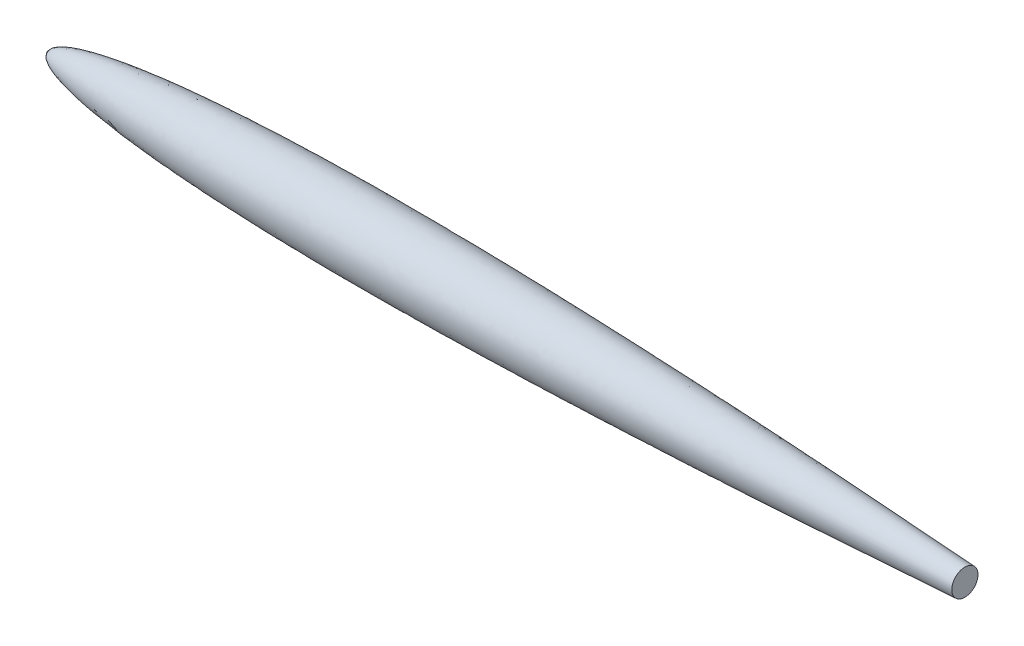
ISO-10303-21;
HEADER;
FILE_DESCRIPTION(('STEP AP214'),'2;1');
FILE_NAME('part.step','',(''),(''),'','','');
FILE_SCHEMA(('AUTOMOTIVE_DESIGN { 1 0 10303 214 1 1 1 1 }'));
ENDSEC;
DATA;
#1=APPLICATION_CONTEXT('core data for automotive mechanical design processes');
#2=APPLICATION_PROTOCOL_DEFINITION('international standard','automotive_design',2000,#1);
#3=PRODUCT_CONTEXT('',#1,'mechanical');
#4=PRODUCT('Part','Part','',(#3));
#5=PRODUCT_RELATED_PRODUCT_CATEGORY('part','',(#4));
#6=PRODUCT_DEFINITION_FORMATION('','',#4);
#7=PRODUCT_DEFINITION_CONTEXT('part definition',#1,'design');
#8=PRODUCT_DEFINITION('design','',#6,#7);
#9=PRODUCT_DEFINITION_SHAPE('','',#8);
#10=(LENGTH_UNIT() NAMED_UNIT(*) SI_UNIT(.MILLI.,.METRE.));
#11=(NAMED_UNIT(*) PLANE_ANGLE_UNIT() SI_UNIT($,.RADIAN.));
#12=(NAMED_UNIT(*) SI_UNIT($,.STERADIAN.) SOLID_ANGLE_UNIT());
#13=UNCERTAINTY_MEASURE_WITH_UNIT(LENGTH_MEASURE(1.E-05),#10,'distance_accuracy_value','');
#14=(GEOMETRIC_REPRESENTATION_CONTEXT(3) GLOBAL_UNCERTAINTY_ASSIGNED_CONTEXT((#13)) GLOBAL_UNIT_ASSIGNED_CONTEXT((#10,
#11,#12)) REPRESENTATION_CONTEXT('',''));
#15=CARTESIAN_POINT('',(0.,0.,0.));
#16=DIRECTION('',(0.,0.,1.));
#17=DIRECTION('',(1.,0.,0.));
#18=AXIS2_PLACEMENT_3D('',#15,#16,#17);
#19=CARTESIAN_POINT('',(9150.0000000009,0.,3.25249348455368E-11));
#20=CARTESIAN_POINT('',(9144.98640785781,0.,-0.364362808966369));
#21=CARTESIAN_POINT('',(9134.82585883528,0.,-1.1019440033658));
#22=CARTESIAN_POINT('',(9115.83518870644,0.,-2.47833214741029));
#23=CARTESIAN_POINT('',(9095.44240012157,0.,-3.95038404000764));
#24=CARTESIAN_POINT('',(9072.49880260651,0.,-5.60285866914893));
#25=CARTESIAN_POINT('',(9050.90490065466,0.,-7.15231159105942));
#26=CARTESIAN_POINT('',(9023.09689726144,0.,-9.14226821706668));
#27=CARTESIAN_POINT('',(8990.16078210902,0.,-11.4889445647607));
#28=CARTESIAN_POINT('',(8951.46889861758,0.,-14.2319555419289));
#29=CARTESIAN_POINT('',(8907.41071077128,0.,-17.3359125778309));
#30=CARTESIAN_POINT('',(8863.26337324389,0.,-20.4273279978867));
#31=CARTESIAN_POINT('',(8819.16579084394,0.,-23.4962864141371));
#32=CARTESIAN_POINT('',(8775.03661127323,0.,-26.5488755360127));
#33=CARTESIAN_POINT('',(8730.92400451567,0.,-29.581765950254));
#34=CARTESIAN_POINT('',(8686.80010442441,0.,-32.5971500541546));
#35=CARTESIAN_POINT('',(8631.64989358924,0.,-36.3433362892716));
#36=CARTESIAN_POINT('',(8565.46388566799,0.,-40.8031680852528));
#37=CARTESIAN_POINT('',(8488.24544527864,0.,-45.95457217338));
#38=CARTESIAN_POINT('',(8399.9899535279,0.,-51.7723973484404));
#39=CARTESIAN_POINT('',(8311.73062277066,0.,-57.5216882044584));
#40=CARTESIAN_POINT('',(8223.46657306881,0.,-63.2035465404444));
#41=CARTESIAN_POINT('',(8113.13140592395,0.,-70.2227339553202));
#42=CARTESIAN_POINT('',(7980.72079358168,0.,-78.5145635114229));
#43=CARTESIAN_POINT('',(7826.23015418569,0.,-88.0006357477079));
#44=CARTESIAN_POINT('',(7649.65409375269,0.,-98.5899224931178));
#45=CARTESIAN_POINT('',(7473.06338698929,0.,-108.931656651455));
#46=CARTESIAN_POINT('',(7296.45853099649,0.,-119.02909619109));
#47=CARTESIAN_POINT('',(7075.68536990581,0.,-131.348153782865));
#48=CARTESIAN_POINT('',(6810.73097475179,0.,-145.648489217315));
#49=CARTESIAN_POINT('',(6501.58011232511,0.,-161.627361411332));
#50=CARTESIAN_POINT('',(6148.21510424575,0.,-178.900408204081));
#51=CARTESIAN_POINT('',(5794.80114828839,0.,-195.142305772217));
#52=CARTESIAN_POINT('',(5441.33845623813,0.,-210.288408278798));
#53=CARTESIAN_POINT('',(5087.8269003981,0.,-224.250429381751));
#54=CARTESIAN_POINT('',(4734.26630522893,0.,-236.91434182519));
#55=CARTESIAN_POINT('',(4380.65683198462,0.,-248.137527841501));
#56=CARTESIAN_POINT('',(4026.99947783512,0.,-257.744990518569));
#57=CARTESIAN_POINT('',(3673.2967812685,0.,-265.523933354978));
#58=CARTESIAN_POINT('',(3319.55378988744,0.,-271.21622343425));
#59=CARTESIAN_POINT('',(3010.0013121393,0.,-274.095543922896));
#60=CARTESIAN_POINT('',(2744.6605540796,0.,-274.819477985501));
#61=CARTESIAN_POINT('',(2523.54436839694,0.,-274.106433958364));
#62=CARTESIAN_POINT('',(2346.65617777361,0.,-272.675700655372));
#63=CARTESIAN_POINT('',(2169.77793971107,0.,-270.304082119264));
#64=CARTESIAN_POINT('',(1992.91641463864,0.,-266.89749057844));
#65=CARTESIAN_POINT('',(1816.08041493059,0.,-262.344959235749));
#66=CARTESIAN_POINT('',(1639.28163297266,0.,-256.512937248457));
#67=CARTESIAN_POINT('',(1484.65172452063,0.,-250.147610484841));
#68=CARTESIAN_POINT('',(1352.18447507634,0.,-243.661385296818));
#69=CARTESIAN_POINT('',(1241.86629509651,0.,-237.485951633078));
#70=CARTESIAN_POINT('',(1153.67740227658,0.,-232.045348732493));
#71=CARTESIAN_POINT('',(1065.52395161267,0.,-226.056192188054));
#72=CARTESIAN_POINT('',(977.413477893536,0.,-219.46309449818));
#73=CARTESIAN_POINT('',(889.355574089518,0.,-212.199179233232));
#74=CARTESIAN_POINT('',(801.362806820226,0.,-204.18185639458));
#75=CARTESIAN_POINT('',(715.101408628902,0.,-195.473660487897));
#76=CARTESIAN_POINT('',(630.588182862538,0.,-186.001106319566));
#77=CARTESIAN_POINT('',(547.845629725913,0.,-175.668869940973));
#78=CARTESIAN_POINT('',(477.022127197957,0.,-165.766869274316));
#79=CARTESIAN_POINT('',(416.451146252535,0.,-156.365751207756));
#80=CARTESIAN_POINT('',(365.766389078118,0.,-147.738368505448));
#81=CARTESIAN_POINT('',(324.914851639068,0.,-140.247080301024));
#82=CARTESIAN_POINT('',(283.852370630478,0.,-132.07440194604));
#83=CARTESIAN_POINT('',(242.618908211362,0.,-123.079119609066));
#84=CARTESIAN_POINT('',(202.190211789807,0.,-113.297577182892));
#85=CARTESIAN_POINT('',(167.437529654724,0.,-103.839028071958));
#86=CARTESIAN_POINT('',(138.33095058616,0.,-94.9404284802377));
#87=CARTESIAN_POINT('',(114.338032980742,0.,-86.7678449578797));
#88=CARTESIAN_POINT('',(94.7921580434131,0.,-79.4525666196687));
#89=CARTESIAN_POINT('',(77.183799538482,0.,-72.0716369409015));
#90=CARTESIAN_POINT('',(61.5403871555576,0.,-64.6524731235147));
#91=CARTESIAN_POINT('',(47.4769122422895,0.,-57.077759187702));
#92=CARTESIAN_POINT('',(36.0876403259283,0.,-50.0707820571584));
#93=CARTESIAN_POINT('',(26.9375564296793,0.,-43.4503615577839));
#94=CARTESIAN_POINT('',(19.969099057962,0.,-37.4421955602541));
#95=CARTESIAN_POINT('',(14.9769321889542,0.,-32.5094812499444));
#96=CARTESIAN_POINT('',(11.4852195554578,0.,-28.5908280663168));
#97=CARTESIAN_POINT('',(8.31103909528372,0.,-24.4289457760324));
#98=CARTESIAN_POINT('',(5.49906631876871,0.,-19.9339593030695));
#99=CARTESIAN_POINT('',(3.43542565771605,0.,-15.8999832466328));
#100=CARTESIAN_POINT('',(1.75485089881354,0.,-11.5942634481142));
#101=CARTESIAN_POINT('',(0.560540129117022,0.,-7.03276212766861));
#102=CARTESIAN_POINT('',(0.101927428830209,0.,-3.52754687470275));
#103=CARTESIAN_POINT('',(0.000160611699827627,0.,-1.17833866807079));
#104=CARTESIAN_POINT('',(0.,0.,0.));
#105=B_SPLINE_CURVE_WITH_KNOTS('',4,(#19,#20,#21,#22,#23,#24,#25,#26,#27,#28,#29,#30,#31,#32,
#33,#34,#35,#36,#37,#38,#39,#40,#41,#42,#43,#44,#45,#46,#47,#48,#49,#50,#51,#52,#53,#54,#55,#56,
#57,#58,#59,#60,#61,#62,#63,#64,#65,#66,#67,#68,#69,#70,#71,#72,#73,#74,#75,#76,#77,#78,#79,#80,
#81,#82,#83,#84,#85,#86,#87,#88,#89,#90,#91,#92,#93,#94,#95,#96,#97,#98,#99,#100,#101,#102,#103,
#104),.UNSPECIFIED.,.F.,.F.,(5,1,1,1,1,1,1,1,1,1,1,1,1,1,1,1,1,1,1,1,1,1,1,1,1,1,1,1,1,1,1,1,1,
1,1,1,1,1,1,1,1,1,1,1,1,1,1,1,1,1,1,1,1,1,1,1,1,1,1,1,1,1,1,1,1,1,1,1,1,1,1,1,1,1,1,1,1,1,1,1,1,
1,5),(0.,0.00218399049332629,0.00436798098665259,0.00655197147997888,0.00873596197330506,
0.0109199524666312,0.0131039429599575,0.0174719239466101,0.0218399049332627,0.0262078859199152,
0.0305758669065677,0.0349438478932202,0.0393118288798728,0.0436798098665253,0.0480477908531778,
0.0524157718398304,0.0611517338131354,0.0698876957864405,0.0786236576885968,0.0873596195907532,
0.0960955814929096,0.104831543395066,0.122303467199379,0.139775391003691,0.157247314726167,
0.174719238448643,0.192191162171118,0.209663085893594,0.244606933696526,0.279550781499459,
0.314494629065928,0.349438476632396,0.384382324291437,0.419326171950477,0.454270019603897,
0.489213867257317,0.524157714808657,0.559101562359998,0.594045409921349,0.6289892574827,
0.646461181201929,0.663933104921158,0.681405028640387,0.698876952359616,0.716348875510399,
0.733820798661181,0.751292721811964,0.768764644962746,0.777491660977801,0.786218676992855,
0.794945693007909,0.803672709022963,0.812399725038017,0.821126741053071,0.829853757068125,
0.838580773083179,0.846652825380426,0.854724877677673,0.862796929974921,0.866832956123544,
0.870868982272168,0.875037162263929,0.87920534225569,0.883373522247451,0.887541702239211,
0.891468997897096,0.893432645726039,0.895396293554981,0.897554586719237,0.899712879883493,
0.900973305631297,0.902233731379101,0.903863140324877,0.904992308472623,0.905428762244264,
0.905865216015906,0.906634793353248,0.907064106863914,0.907493420374579,0.907957873985981,
0.908422327597384,0.908886781208786,0.909351234820188),.UNSPECIFIED.);
#106=CARTESIAN_POINT('',(0.,0.,0.));
#107=DIRECTION('',(-1.,0.,0.));
#108=AXIS1_PLACEMENT('',#106,#107);
#109=SURFACE_OF_REVOLUTION('',#105,#108);
#110=CARTESIAN_POINT('',(0.,0.,0.));
#111=VERTEX_POINT('',#110);
#112=VERTEX_LOOP('',#111);
#113=FACE_BOUND('',#112,.T.);
#114=CARTESIAN_POINT('',(7503.,0.,0.));
#115=DIRECTION('',(-1.,0.,0.));
#116=DIRECTION('',(0.,0.,1.));
#117=AXIS2_PLACEMENT_3D('',#114,#115,#116);
#118=CIRCLE('',#117,107.144631984346);
#119=CARTESIAN_POINT('',(7503.,0.,107.144631984346));
#120=VERTEX_POINT('',#119);
#121=EDGE_CURVE('E11',#120,#120,#118,.F.);
#122=ORIENTED_EDGE('',*,*,#121,.F.);
#123=EDGE_LOOP('',(#122));
#124=FACE_BOUND('',#123,.T.);
#125=ADVANCED_FACE('F36',(#113,#124),#109,.T.);
#126=CARTESIAN_POINT('',(7503.,0.,0.));
#127=DIRECTION('',(1.,0.,0.));
#128=DIRECTION('',(0.,0.,-1.));
#129=AXIS2_PLACEMENT_3D('',#126,#127,#128);
#130=PLANE('',#129);
#131=ORIENTED_EDGE('',*,*,#121,.T.);
#132=EDGE_LOOP('',(#131));
#133=FACE_BOUND('',#132,.T.);
#134=ADVANCED_FACE('F46',(#133),#130,.T.);
#135=CLOSED_SHELL('',(#125,#134));
#136=MANIFOLD_SOLID_BREP('B2',#135);
#137=ADVANCED_BREP_SHAPE_REPRESENTATION('',(#18,#136),#14);
#138=SHAPE_DEFINITION_REPRESENTATION(#9,#137);
ENDSEC;
END-ISO-10303-21;
